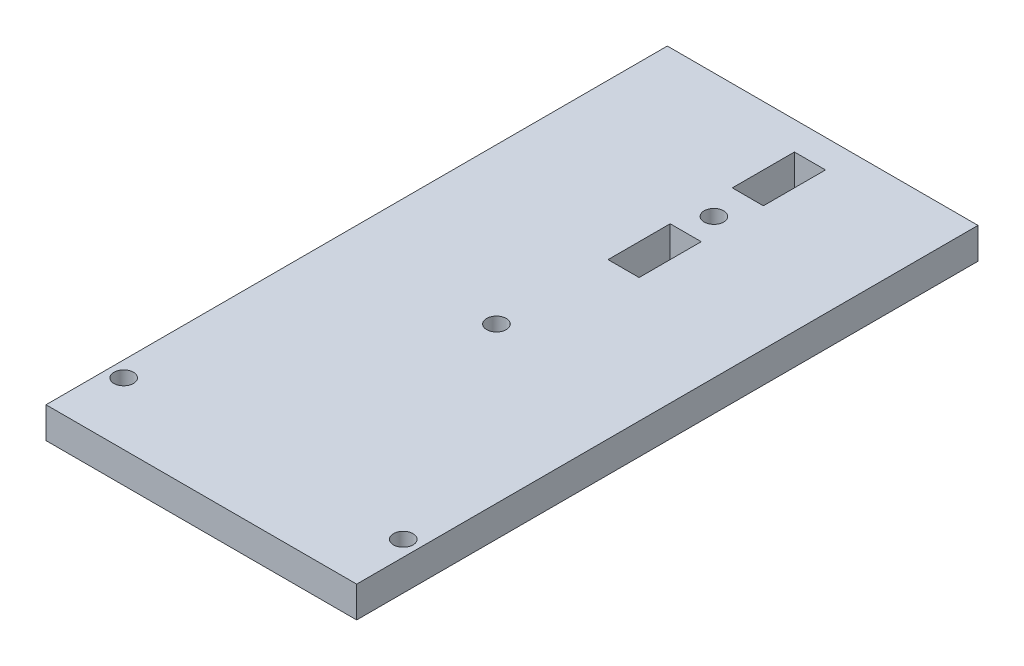
ISO-10303-21;
HEADER;
FILE_DESCRIPTION(('STEP AP214'),'2;1');
FILE_NAME('part.step','',(''),(''),'','','');
FILE_SCHEMA(('AUTOMOTIVE_DESIGN { 1 0 10303 214 1 1 1 1 }'));
ENDSEC;
DATA;
#1=APPLICATION_CONTEXT('core data for automotive mechanical design processes');
#2=APPLICATION_PROTOCOL_DEFINITION('international standard','automotive_design',2000,#1);
#3=PRODUCT_CONTEXT('',#1,'mechanical');
#4=PRODUCT('Part','Part','',(#3));
#5=PRODUCT_RELATED_PRODUCT_CATEGORY('part','',(#4));
#6=PRODUCT_DEFINITION_FORMATION('','',#4);
#7=PRODUCT_DEFINITION_CONTEXT('part definition',#1,'design');
#8=PRODUCT_DEFINITION('design','',#6,#7);
#9=PRODUCT_DEFINITION_SHAPE('','',#8);
#10=(LENGTH_UNIT() NAMED_UNIT(*) SI_UNIT(.MILLI.,.METRE.));
#11=(NAMED_UNIT(*) PLANE_ANGLE_UNIT() SI_UNIT($,.RADIAN.));
#12=(NAMED_UNIT(*) SI_UNIT($,.STERADIAN.) SOLID_ANGLE_UNIT());
#13=UNCERTAINTY_MEASURE_WITH_UNIT(LENGTH_MEASURE(1.E-05),#10,'distance_accuracy_value','');
#14=(GEOMETRIC_REPRESENTATION_CONTEXT(3) GLOBAL_UNCERTAINTY_ASSIGNED_CONTEXT((#13)) GLOBAL_UNIT_ASSIGNED_CONTEXT((#10,
#11,#12)) REPRESENTATION_CONTEXT('',''));
#15=CARTESIAN_POINT('',(0.,0.,0.));
#16=DIRECTION('',(0.,0.,1.));
#17=DIRECTION('',(1.,0.,0.));
#18=AXIS2_PLACEMENT_3D('',#15,#16,#17);
#19=CARTESIAN_POINT('',(0.,6.35,0.));
#20=DIRECTION('',(0.,-1.,0.));
#21=DIRECTION('',(0.,0.,-1.));
#22=AXIS2_PLACEMENT_3D('',#19,#20,#21);
#23=PLANE('',#22);
#24=DIRECTION('',(1.,0.,0.));
#25=VECTOR('',#24,1.);
#26=CARTESIAN_POINT('',(31.75,6.35,-108.530021549942));
#27=LINE('',#26,#25);
#28=CARTESIAN_POINT('',(31.75,6.35,-108.530021549942));
#29=VERTEX_POINT('',#28);
#30=CARTESIAN_POINT('',(38.1,6.35,-108.530021549942));
#31=VERTEX_POINT('',#30);
#32=EDGE_CURVE('E149',#29,#31,#27,.T.);
#33=ORIENTED_EDGE('',*,*,#32,.F.);
#34=DIRECTION('',(0.,0.,1.));
#35=VECTOR('',#34,1.);
#36=CARTESIAN_POINT('',(31.75,6.35,-108.530021549942));
#37=LINE('',#36,#35);
#38=CARTESIAN_POINT('',(31.75,6.35,-121.230021549942));
#39=VERTEX_POINT('',#38);
#40=EDGE_CURVE('E48',#39,#29,#37,.T.);
#41=ORIENTED_EDGE('',*,*,#40,.F.);
#42=DIRECTION('',(-1.,0.,0.));
#43=VECTOR('',#42,1.);
#44=CARTESIAN_POINT('',(31.75,6.35,-121.230021549942));
#45=LINE('',#44,#43);
#46=CARTESIAN_POINT('',(38.1,6.35,-121.230021549942));
#47=VERTEX_POINT('',#46);
#48=EDGE_CURVE('E140',#47,#39,#45,.T.);
#49=ORIENTED_EDGE('',*,*,#48,.F.);
#50=DIRECTION('',(0.,0.,-1.));
#51=VECTOR('',#50,1.);
#52=CARTESIAN_POINT('',(38.1,6.35,-108.530021549942));
#53=LINE('',#52,#51);
#54=EDGE_CURVE('E143',#31,#47,#53,.T.);
#55=ORIENTED_EDGE('',*,*,#54,.F.);
#56=EDGE_LOOP('',(#33,#41,#49,#55));
#57=FACE_BOUND('',#56,.T.);
#58=DIRECTION('',(1.,0.,0.));
#59=VECTOR('',#58,1.);
#60=CARTESIAN_POINT('',(31.75,6.35,-83.1300215499425));
#61=LINE('',#60,#59);
#62=CARTESIAN_POINT('',(31.75,6.35,-83.1300215499425));
#63=VERTEX_POINT('',#62);
#64=CARTESIAN_POINT('',(38.1,6.35,-83.1300215499425));
#65=VERTEX_POINT('',#64);
#66=EDGE_CURVE('E174',#63,#65,#61,.T.);
#67=ORIENTED_EDGE('',*,*,#66,.F.);
#68=DIRECTION('',(0.,0.,1.));
#69=VECTOR('',#68,1.);
#70=CARTESIAN_POINT('',(31.75,6.35,-95.8300215499425));
#71=LINE('',#70,#69);
#72=CARTESIAN_POINT('',(31.75,6.35,-95.8300215499425));
#73=VERTEX_POINT('',#72);
#74=EDGE_CURVE('E155',#73,#63,#71,.T.);
#75=ORIENTED_EDGE('',*,*,#74,.F.);
#76=DIRECTION('',(-1.,0.,0.));
#77=VECTOR('',#76,1.);
#78=CARTESIAN_POINT('',(31.75,6.35,-95.8300215499425));
#79=LINE('',#78,#77);
#80=CARTESIAN_POINT('',(38.1,6.35,-95.8300215499425));
#81=VERTEX_POINT('',#80);
#82=EDGE_CURVE('E163',#81,#73,#79,.T.);
#83=ORIENTED_EDGE('',*,*,#82,.F.);
#84=DIRECTION('',(0.,0.,-1.));
#85=VECTOR('',#84,1.);
#86=CARTESIAN_POINT('',(38.1,6.35,-95.8300215499425));
#87=LINE('',#86,#85);
#88=EDGE_CURVE('E177',#65,#81,#87,.T.);
#89=ORIENTED_EDGE('',*,*,#88,.F.);
#90=EDGE_LOOP('',(#67,#75,#83,#89));
#91=FACE_BOUND('',#90,.T.);
#92=CARTESIAN_POINT('',(34.925,6.35,-101.6));
#93=DIRECTION('',(0.,1.,0.));
#94=DIRECTION('',(0.,0.,1.));
#95=AXIS2_PLACEMENT_3D('',#92,#93,#94);
#96=CIRCLE('',#95,2.);
#97=CARTESIAN_POINT('',(34.925,6.35,-99.6));
#98=VERTEX_POINT('',#97);
#99=EDGE_CURVE('E184',#98,#98,#96,.T.);
#100=ORIENTED_EDGE('',*,*,#99,.F.);
#101=EDGE_LOOP('',(#100));
#102=FACE_BOUND('',#101,.T.);
#103=DIRECTION('',(0.,0.,1.));
#104=VECTOR('',#103,1.);
#105=CARTESIAN_POINT('',(0.,6.35,0.));
#106=LINE('',#105,#104);
#107=CARTESIAN_POINT('',(0.,6.35,-127.));
#108=VERTEX_POINT('',#107);
#109=CARTESIAN_POINT('',(0.,6.35,0.));
#110=VERTEX_POINT('',#109);
#111=EDGE_CURVE('E215',#108,#110,#106,.T.);
#112=ORIENTED_EDGE('',*,*,#111,.T.);
#113=DIRECTION('',(1.,0.,0.));
#114=VECTOR('',#113,1.);
#115=CARTESIAN_POINT('',(0.,6.35,0.));
#116=LINE('',#115,#114);
#117=CARTESIAN_POINT('',(63.5,6.35,0.));
#118=VERTEX_POINT('',#117);
#119=EDGE_CURVE('E218',#110,#118,#116,.T.);
#120=ORIENTED_EDGE('',*,*,#119,.T.);
#121=DIRECTION('',(0.,0.,-1.));
#122=VECTOR('',#121,1.);
#123=CARTESIAN_POINT('',(63.5,6.35,0.));
#124=LINE('',#123,#122);
#125=CARTESIAN_POINT('',(63.5,6.35,-127.));
#126=VERTEX_POINT('',#125);
#127=EDGE_CURVE('E221',#118,#126,#124,.T.);
#128=ORIENTED_EDGE('',*,*,#127,.T.);
#129=DIRECTION('',(-1.,0.,0.));
#130=VECTOR('',#129,1.);
#131=CARTESIAN_POINT('',(0.,6.35,-127.));
#132=LINE('',#131,#130);
#133=EDGE_CURVE('E223',#126,#108,#132,.T.);
#134=ORIENTED_EDGE('',*,*,#133,.T.);
#135=EDGE_LOOP('',(#112,#120,#128,#134));
#136=FACE_BOUND('',#135,.T.);
#137=CARTESIAN_POINT('',(3.175,6.35,-12.7));
#138=DIRECTION('',(0.,1.,0.));
#139=DIRECTION('',(0.,0.,1.));
#140=AXIS2_PLACEMENT_3D('',#137,#138,#139);
#141=CIRCLE('',#140,2.);
#142=CARTESIAN_POINT('',(3.175,6.35,-10.7));
#143=VERTEX_POINT('',#142);
#144=EDGE_CURVE('E209',#143,#143,#141,.T.);
#145=ORIENTED_EDGE('',*,*,#144,.F.);
#146=EDGE_LOOP('',(#145));
#147=FACE_BOUND('',#146,.T.);
#148=CARTESIAN_POINT('',(60.325,6.35,-12.7));
#149=DIRECTION('',(0.,1.,0.));
#150=DIRECTION('',(0.,0.,1.));
#151=AXIS2_PLACEMENT_3D('',#148,#149,#150);
#152=CIRCLE('',#151,2.);
#153=CARTESIAN_POINT('',(60.325,6.35,-10.7));
#154=VERTEX_POINT('',#153);
#155=EDGE_CURVE('E203',#154,#154,#152,.T.);
#156=ORIENTED_EDGE('',*,*,#155,.F.);
#157=EDGE_LOOP('',(#156));
#158=FACE_BOUND('',#157,.T.);
#159=CARTESIAN_POINT('',(31.75,6.35,-60.325));
#160=DIRECTION('',(0.,1.,0.));
#161=DIRECTION('',(0.,0.,1.));
#162=AXIS2_PLACEMENT_3D('',#159,#160,#161);
#163=CIRCLE('',#162,2.);
#164=CARTESIAN_POINT('',(31.75,6.35,-58.325));
#165=VERTEX_POINT('',#164);
#166=EDGE_CURVE('E197',#165,#165,#163,.T.);
#167=ORIENTED_EDGE('',*,*,#166,.F.);
#168=EDGE_LOOP('',(#167));
#169=FACE_BOUND('',#168,.T.);
#170=ADVANCED_FACE('F33',(#57,#91,#102,#136,#147,#158,#169),#23,.F.);
#171=CARTESIAN_POINT('',(0.,0.,0.));
#172=DIRECTION('',(0.,-1.,0.));
#173=DIRECTION('',(0.,0.,-1.));
#174=AXIS2_PLACEMENT_3D('',#171,#172,#173);
#175=PLANE('',#174);
#176=DIRECTION('',(0.,0.,1.));
#177=VECTOR('',#176,1.);
#178=CARTESIAN_POINT('',(31.75,0.,-108.530021549942));
#179=LINE('',#178,#177);
#180=CARTESIAN_POINT('',(31.75,0.,-121.230021549942));
#181=VERTEX_POINT('',#180);
#182=CARTESIAN_POINT('',(31.75,0.,-108.530021549942));
#183=VERTEX_POINT('',#182);
#184=EDGE_CURVE('E124',#181,#183,#179,.T.);
#185=ORIENTED_EDGE('',*,*,#184,.T.);
#186=DIRECTION('',(1.,0.,0.));
#187=VECTOR('',#186,1.);
#188=CARTESIAN_POINT('',(31.75,0.,-108.530021549942));
#189=LINE('',#188,#187);
#190=CARTESIAN_POINT('',(38.1,0.,-108.530021549942));
#191=VERTEX_POINT('',#190);
#192=EDGE_CURVE('E133',#183,#191,#189,.T.);
#193=ORIENTED_EDGE('',*,*,#192,.T.);
#194=DIRECTION('',(0.,0.,-1.));
#195=VECTOR('',#194,1.);
#196=CARTESIAN_POINT('',(38.1,0.,-108.530021549942));
#197=LINE('',#196,#195);
#198=CARTESIAN_POINT('',(38.1,0.,-121.230021549942));
#199=VERTEX_POINT('',#198);
#200=EDGE_CURVE('E56',#191,#199,#197,.T.);
#201=ORIENTED_EDGE('',*,*,#200,.T.);
#202=DIRECTION('',(-1.,0.,0.));
#203=VECTOR('',#202,1.);
#204=CARTESIAN_POINT('',(31.75,0.,-121.230021549942));
#205=LINE('',#204,#203);
#206=EDGE_CURVE('E130',#199,#181,#205,.T.);
#207=ORIENTED_EDGE('',*,*,#206,.T.);
#208=EDGE_LOOP('',(#185,#193,#201,#207));
#209=FACE_BOUND('',#208,.T.);
#210=DIRECTION('',(0.,0.,1.));
#211=VECTOR('',#210,1.);
#212=CARTESIAN_POINT('',(31.75,0.,-95.8300215499425));
#213=LINE('',#212,#211);
#214=CARTESIAN_POINT('',(31.75,0.,-95.8300215499425));
#215=VERTEX_POINT('',#214);
#216=CARTESIAN_POINT('',(31.75,0.,-83.1300215499425));
#217=VERTEX_POINT('',#216);
#218=EDGE_CURVE('E159',#215,#217,#213,.T.);
#219=ORIENTED_EDGE('',*,*,#218,.T.);
#220=DIRECTION('',(1.,0.,0.));
#221=VECTOR('',#220,1.);
#222=CARTESIAN_POINT('',(31.75,0.,-83.1300215499425));
#223=LINE('',#222,#221);
#224=CARTESIAN_POINT('',(38.1,0.,-83.1300215499425));
#225=VERTEX_POINT('',#224);
#226=EDGE_CURVE('E162',#217,#225,#223,.T.);
#227=ORIENTED_EDGE('',*,*,#226,.T.);
#228=DIRECTION('',(0.,0.,-1.));
#229=VECTOR('',#228,1.);
#230=CARTESIAN_POINT('',(38.1,0.,-95.8300215499425));
#231=LINE('',#230,#229);
#232=CARTESIAN_POINT('',(38.1,0.,-95.8300215499425));
#233=VERTEX_POINT('',#232);
#234=EDGE_CURVE('E166',#225,#233,#231,.T.);
#235=ORIENTED_EDGE('',*,*,#234,.T.);
#236=DIRECTION('',(-1.,0.,0.));
#237=VECTOR('',#236,1.);
#238=CARTESIAN_POINT('',(31.75,0.,-95.8300215499425));
#239=LINE('',#238,#237);
#240=EDGE_CURVE('E169',#233,#215,#239,.T.);
#241=ORIENTED_EDGE('',*,*,#240,.T.);
#242=EDGE_LOOP('',(#219,#227,#235,#241));
#243=FACE_BOUND('',#242,.T.);
#244=CARTESIAN_POINT('',(34.925,0.,-101.6));
#245=DIRECTION('',(0.,1.,0.));
#246=DIRECTION('',(0.,0.,1.));
#247=AXIS2_PLACEMENT_3D('',#244,#245,#246);
#248=CIRCLE('',#247,2.);
#249=CARTESIAN_POINT('',(34.925,0.,-99.6));
#250=VERTEX_POINT('',#249);
#251=EDGE_CURVE('E191',#250,#250,#248,.T.);
#252=ORIENTED_EDGE('',*,*,#251,.T.);
#253=EDGE_LOOP('',(#252));
#254=FACE_BOUND('',#253,.T.);
#255=CARTESIAN_POINT('',(60.325,0.,-12.7));
#256=DIRECTION('',(0.,1.,0.));
#257=DIRECTION('',(0.,0.,1.));
#258=AXIS2_PLACEMENT_3D('',#255,#256,#257);
#259=CIRCLE('',#258,2.);
#260=CARTESIAN_POINT('',(60.325,0.,-10.7));
#261=VERTEX_POINT('',#260);
#262=EDGE_CURVE('E200',#261,#261,#259,.T.);
#263=ORIENTED_EDGE('',*,*,#262,.T.);
#264=EDGE_LOOP('',(#263));
#265=FACE_BOUND('',#264,.T.);
#266=DIRECTION('',(0.,0.,1.));
#267=VECTOR('',#266,1.);
#268=CARTESIAN_POINT('',(0.,0.,0.));
#269=LINE('',#268,#267);
#270=CARTESIAN_POINT('',(0.,0.,-127.));
#271=VERTEX_POINT('',#270);
#272=CARTESIAN_POINT('',(0.,0.,0.));
#273=VERTEX_POINT('',#272);
#274=EDGE_CURVE('E212',#271,#273,#269,.T.);
#275=ORIENTED_EDGE('',*,*,#274,.F.);
#276=DIRECTION('',(-1.,0.,0.));
#277=VECTOR('',#276,1.);
#278=CARTESIAN_POINT('',(0.,0.,-127.));
#279=LINE('',#278,#277);
#280=CARTESIAN_POINT('',(63.5,0.,-127.));
#281=VERTEX_POINT('',#280);
#282=EDGE_CURVE('E219',#281,#271,#279,.T.);
#283=ORIENTED_EDGE('',*,*,#282,.F.);
#284=DIRECTION('',(0.,0.,-1.));
#285=VECTOR('',#284,1.);
#286=CARTESIAN_POINT('',(63.5,0.,0.));
#287=LINE('',#286,#285);
#288=CARTESIAN_POINT('',(63.5,0.,0.));
#289=VERTEX_POINT('',#288);
#290=EDGE_CURVE('E230',#289,#281,#287,.T.);
#291=ORIENTED_EDGE('',*,*,#290,.F.);
#292=DIRECTION('',(1.,0.,0.));
#293=VECTOR('',#292,1.);
#294=CARTESIAN_POINT('',(0.,0.,0.));
#295=LINE('',#294,#293);
#296=EDGE_CURVE('E228',#273,#289,#295,.T.);
#297=ORIENTED_EDGE('',*,*,#296,.F.);
#298=EDGE_LOOP('',(#275,#283,#291,#297));
#299=FACE_BOUND('',#298,.T.);
#300=CARTESIAN_POINT('',(3.175,0.,-12.7));
#301=DIRECTION('',(0.,1.,0.));
#302=DIRECTION('',(0.,0.,1.));
#303=AXIS2_PLACEMENT_3D('',#300,#301,#302);
#304=CIRCLE('',#303,2.);
#305=CARTESIAN_POINT('',(3.175,0.,-10.7));
#306=VERTEX_POINT('',#305);
#307=EDGE_CURVE('E206',#306,#306,#304,.T.);
#308=ORIENTED_EDGE('',*,*,#307,.T.);
#309=EDGE_LOOP('',(#308));
#310=FACE_BOUND('',#309,.T.);
#311=CARTESIAN_POINT('',(31.75,0.,-60.325));
#312=DIRECTION('',(0.,1.,0.));
#313=DIRECTION('',(0.,0.,1.));
#314=AXIS2_PLACEMENT_3D('',#311,#312,#313);
#315=CIRCLE('',#314,2.);
#316=CARTESIAN_POINT('',(31.75,0.,-58.325));
#317=VERTEX_POINT('',#316);
#318=EDGE_CURVE('E194',#317,#317,#315,.T.);
#319=ORIENTED_EDGE('',*,*,#318,.T.);
#320=EDGE_LOOP('',(#319));
#321=FACE_BOUND('',#320,.T.);
#322=ADVANCED_FACE('F137',(#209,#243,#254,#265,#299,#310,#321),#175,.T.);
#323=CARTESIAN_POINT('',(0.,6.35,0.));
#324=DIRECTION('',(1.,0.,0.));
#325=DIRECTION('',(0.,0.,-1.));
#326=AXIS2_PLACEMENT_3D('',#323,#324,#325);
#327=PLANE('',#326);
#328=ORIENTED_EDGE('',*,*,#274,.T.);
#329=DIRECTION('',(0.,-1.,0.));
#330=VECTOR('',#329,1.);
#331=CARTESIAN_POINT('',(0.,6.35,0.));
#332=LINE('',#331,#330);
#333=EDGE_CURVE('E11',#110,#273,#332,.T.);
#334=ORIENTED_EDGE('',*,*,#333,.F.);
#335=ORIENTED_EDGE('',*,*,#111,.F.);
#336=DIRECTION('',(0.,-1.,0.));
#337=VECTOR('',#336,1.);
#338=CARTESIAN_POINT('',(0.,6.35,-127.));
#339=LINE('',#338,#337);
#340=EDGE_CURVE('E225',#108,#271,#339,.T.);
#341=ORIENTED_EDGE('',*,*,#340,.T.);
#342=EDGE_LOOP('',(#328,#334,#335,#341));
#343=FACE_BOUND('',#342,.T.);
#344=ADVANCED_FACE('F35',(#343),#327,.F.);
#345=CARTESIAN_POINT('',(0.,6.35,0.));
#346=DIRECTION('',(0.,0.,-1.));
#347=DIRECTION('',(-1.,0.,0.));
#348=AXIS2_PLACEMENT_3D('',#345,#346,#347);
#349=PLANE('',#348);
#350=ORIENTED_EDGE('',*,*,#296,.T.);
#351=DIRECTION('',(0.,-1.,0.));
#352=VECTOR('',#351,1.);
#353=CARTESIAN_POINT('',(63.5,6.35,0.));
#354=LINE('',#353,#352);
#355=EDGE_CURVE('E41',#118,#289,#354,.T.);
#356=ORIENTED_EDGE('',*,*,#355,.F.);
#357=ORIENTED_EDGE('',*,*,#119,.F.);
#358=ORIENTED_EDGE('',*,*,#333,.T.);
#359=EDGE_LOOP('',(#350,#356,#357,#358));
#360=FACE_BOUND('',#359,.T.);
#361=ADVANCED_FACE('F258',(#360),#349,.F.);
#362=CARTESIAN_POINT('',(63.5,6.35,0.));
#363=DIRECTION('',(-1.,0.,0.));
#364=DIRECTION('',(0.,0.,1.));
#365=AXIS2_PLACEMENT_3D('',#362,#363,#364);
#366=PLANE('',#365);
#367=ORIENTED_EDGE('',*,*,#290,.T.);
#368=DIRECTION('',(0.,-1.,0.));
#369=VECTOR('',#368,1.);
#370=CARTESIAN_POINT('',(63.5,6.35,-127.));
#371=LINE('',#370,#369);
#372=EDGE_CURVE('E235',#126,#281,#371,.T.);
#373=ORIENTED_EDGE('',*,*,#372,.F.);
#374=ORIENTED_EDGE('',*,*,#127,.F.);
#375=ORIENTED_EDGE('',*,*,#355,.T.);
#376=EDGE_LOOP('',(#367,#373,#374,#375));
#377=FACE_BOUND('',#376,.T.);
#378=ADVANCED_FACE('F242',(#377),#366,.F.);
#379=CARTESIAN_POINT('',(0.,6.35,-127.));
#380=DIRECTION('',(0.,0.,1.));
#381=DIRECTION('',(1.,0.,0.));
#382=AXIS2_PLACEMENT_3D('',#379,#380,#381);
#383=PLANE('',#382);
#384=ORIENTED_EDGE('',*,*,#282,.T.);
#385=ORIENTED_EDGE('',*,*,#340,.F.);
#386=ORIENTED_EDGE('',*,*,#133,.F.);
#387=ORIENTED_EDGE('',*,*,#372,.T.);
#388=EDGE_LOOP('',(#384,#385,#386,#387));
#389=FACE_BOUND('',#388,.T.);
#390=ADVANCED_FACE('F251',(#389),#383,.F.);
#391=CARTESIAN_POINT('',(3.175,6.35,-12.7));
#392=DIRECTION('',(0.,-1.,0.));
#393=DIRECTION('',(0.,0.,-1.));
#394=AXIS2_PLACEMENT_3D('',#391,#392,#393);
#395=CYLINDRICAL_SURFACE('',#394,2.);
#396=ORIENTED_EDGE('',*,*,#144,.T.);
#397=EDGE_LOOP('',(#396));
#398=FACE_BOUND('',#397,.T.);
#399=ORIENTED_EDGE('',*,*,#307,.F.);
#400=EDGE_LOOP('',(#399));
#401=FACE_BOUND('',#400,.T.);
#402=ADVANCED_FACE('F274',(#398,#401),#395,.F.);
#403=CARTESIAN_POINT('',(60.325,6.35,-12.7));
#404=DIRECTION('',(0.,-1.,0.));
#405=DIRECTION('',(0.,0.,-1.));
#406=AXIS2_PLACEMENT_3D('',#403,#404,#405);
#407=CYLINDRICAL_SURFACE('',#406,2.);
#408=ORIENTED_EDGE('',*,*,#155,.T.);
#409=EDGE_LOOP('',(#408));
#410=FACE_BOUND('',#409,.T.);
#411=ORIENTED_EDGE('',*,*,#262,.F.);
#412=EDGE_LOOP('',(#411));
#413=FACE_BOUND('',#412,.T.);
#414=ADVANCED_FACE('F281',(#410,#413),#407,.F.);
#415=CARTESIAN_POINT('',(31.75,6.35,-60.325));
#416=DIRECTION('',(0.,-1.,0.));
#417=DIRECTION('',(0.,0.,-1.));
#418=AXIS2_PLACEMENT_3D('',#415,#416,#417);
#419=CYLINDRICAL_SURFACE('',#418,2.);
#420=ORIENTED_EDGE('',*,*,#166,.T.);
#421=EDGE_LOOP('',(#420));
#422=FACE_BOUND('',#421,.T.);
#423=ORIENTED_EDGE('',*,*,#318,.F.);
#424=EDGE_LOOP('',(#423));
#425=FACE_BOUND('',#424,.T.);
#426=ADVANCED_FACE('F286',(#422,#425),#419,.F.);
#427=CARTESIAN_POINT('',(34.925,0.,-101.6));
#428=DIRECTION('',(0.,1.,0.));
#429=DIRECTION('',(0.,0.,1.));
#430=AXIS2_PLACEMENT_3D('',#427,#428,#429);
#431=CYLINDRICAL_SURFACE('',#430,2.);
#432=ORIENTED_EDGE('',*,*,#251,.F.);
#433=EDGE_LOOP('',(#432));
#434=FACE_BOUND('',#433,.T.);
#435=ORIENTED_EDGE('',*,*,#99,.T.);
#436=EDGE_LOOP('',(#435));
#437=FACE_BOUND('',#436,.T.);
#438=ADVANCED_FACE('F295',(#434,#437),#431,.F.);
#439=CARTESIAN_POINT('',(31.75,0.,-95.8300215499425));
#440=DIRECTION('',(-1.,0.,0.));
#441=DIRECTION('',(0.,0.,1.));
#442=AXIS2_PLACEMENT_3D('',#439,#440,#441);
#443=PLANE('',#442);
#444=ORIENTED_EDGE('',*,*,#74,.T.);
#445=DIRECTION('',(0.,1.,0.));
#446=VECTOR('',#445,1.);
#447=CARTESIAN_POINT('',(31.75,0.,-83.1300215499425));
#448=LINE('',#447,#446);
#449=EDGE_CURVE('E172',#217,#63,#448,.T.);
#450=ORIENTED_EDGE('',*,*,#449,.F.);
#451=ORIENTED_EDGE('',*,*,#218,.F.);
#452=DIRECTION('',(0.,1.,0.));
#453=VECTOR('',#452,1.);
#454=CARTESIAN_POINT('',(31.75,0.,-95.8300215499425));
#455=LINE('',#454,#453);
#456=EDGE_CURVE('E182',#215,#73,#455,.T.);
#457=ORIENTED_EDGE('',*,*,#456,.T.);
#458=EDGE_LOOP('',(#444,#450,#451,#457));
#459=FACE_BOUND('',#458,.T.);
#460=ADVANCED_FACE('F301',(#459),#443,.F.);
#461=CARTESIAN_POINT('',(31.75,0.,-95.8300215499425));
#462=DIRECTION('',(0.,0.,-1.));
#463=DIRECTION('',(-1.,0.,0.));
#464=AXIS2_PLACEMENT_3D('',#461,#462,#463);
#465=PLANE('',#464);
#466=ORIENTED_EDGE('',*,*,#82,.T.);
#467=ORIENTED_EDGE('',*,*,#456,.F.);
#468=ORIENTED_EDGE('',*,*,#240,.F.);
#469=DIRECTION('',(0.,1.,0.));
#470=VECTOR('',#469,1.);
#471=CARTESIAN_POINT('',(38.1,0.,-95.8300215499425));
#472=LINE('',#471,#470);
#473=EDGE_CURVE('E185',#233,#81,#472,.T.);
#474=ORIENTED_EDGE('',*,*,#473,.T.);
#475=EDGE_LOOP('',(#466,#467,#468,#474));
#476=FACE_BOUND('',#475,.T.);
#477=ADVANCED_FACE('F307',(#476),#465,.F.);
#478=CARTESIAN_POINT('',(38.1,0.,-95.8300215499425));
#479=DIRECTION('',(1.,0.,0.));
#480=DIRECTION('',(0.,0.,-1.));
#481=AXIS2_PLACEMENT_3D('',#478,#479,#480);
#482=PLANE('',#481);
#483=ORIENTED_EDGE('',*,*,#88,.T.);
#484=ORIENTED_EDGE('',*,*,#473,.F.);
#485=ORIENTED_EDGE('',*,*,#234,.F.);
#486=DIRECTION('',(0.,1.,0.));
#487=VECTOR('',#486,1.);
#488=CARTESIAN_POINT('',(38.1,0.,-83.1300215499425));
#489=LINE('',#488,#487);
#490=EDGE_CURVE('E187',#225,#65,#489,.T.);
#491=ORIENTED_EDGE('',*,*,#490,.T.);
#492=EDGE_LOOP('',(#483,#484,#485,#491));
#493=FACE_BOUND('',#492,.T.);
#494=ADVANCED_FACE('F312',(#493),#482,.F.);
#495=CARTESIAN_POINT('',(31.75,0.,-83.1300215499425));
#496=DIRECTION('',(0.,0.,1.));
#497=DIRECTION('',(1.,0.,0.));
#498=AXIS2_PLACEMENT_3D('',#495,#496,#497);
#499=PLANE('',#498);
#500=ORIENTED_EDGE('',*,*,#66,.T.);
#501=ORIENTED_EDGE('',*,*,#490,.F.);
#502=ORIENTED_EDGE('',*,*,#226,.F.);
#503=ORIENTED_EDGE('',*,*,#449,.T.);
#504=EDGE_LOOP('',(#500,#501,#502,#503));
#505=FACE_BOUND('',#504,.T.);
#506=ADVANCED_FACE('F309',(#505),#499,.F.);
#507=CARTESIAN_POINT('',(31.75,0.,-108.530021549942));
#508=DIRECTION('',(-1.,0.,0.));
#509=DIRECTION('',(0.,0.,1.));
#510=AXIS2_PLACEMENT_3D('',#507,#508,#509);
#511=PLANE('',#510);
#512=ORIENTED_EDGE('',*,*,#40,.T.);
#513=DIRECTION('',(0.,1.,0.));
#514=VECTOR('',#513,1.);
#515=CARTESIAN_POINT('',(31.75,0.,-108.530021549942));
#516=LINE('',#515,#514);
#517=EDGE_CURVE('E120',#183,#29,#516,.T.);
#518=ORIENTED_EDGE('',*,*,#517,.F.);
#519=ORIENTED_EDGE('',*,*,#184,.F.);
#520=DIRECTION('',(0.,1.,0.));
#521=VECTOR('',#520,1.);
#522=CARTESIAN_POINT('',(31.75,0.,-121.230021549942));
#523=LINE('',#522,#521);
#524=EDGE_CURVE('E153',#181,#39,#523,.T.);
#525=ORIENTED_EDGE('',*,*,#524,.T.);
#526=EDGE_LOOP('',(#512,#518,#519,#525));
#527=FACE_BOUND('',#526,.T.);
#528=ADVANCED_FACE('F122',(#527),#511,.F.);
#529=CARTESIAN_POINT('',(31.75,0.,-121.230021549942));
#530=DIRECTION('',(0.,0.,-1.));
#531=DIRECTION('',(-1.,0.,0.));
#532=AXIS2_PLACEMENT_3D('',#529,#530,#531);
#533=PLANE('',#532);
#534=ORIENTED_EDGE('',*,*,#48,.T.);
#535=ORIENTED_EDGE('',*,*,#524,.F.);
#536=ORIENTED_EDGE('',*,*,#206,.F.);
#537=DIRECTION('',(0.,1.,0.));
#538=VECTOR('',#537,1.);
#539=CARTESIAN_POINT('',(38.1,0.,-121.230021549942));
#540=LINE('',#539,#538);
#541=EDGE_CURVE('E156',#199,#47,#540,.T.);
#542=ORIENTED_EDGE('',*,*,#541,.T.);
#543=EDGE_LOOP('',(#534,#535,#536,#542));
#544=FACE_BOUND('',#543,.T.);
#545=ADVANCED_FACE('F322',(#544),#533,.F.);
#546=CARTESIAN_POINT('',(38.1,0.,-108.530021549942));
#547=DIRECTION('',(1.,0.,0.));
#548=DIRECTION('',(0.,0.,-1.));
#549=AXIS2_PLACEMENT_3D('',#546,#547,#548);
#550=PLANE('',#549);
#551=ORIENTED_EDGE('',*,*,#54,.T.);
#552=ORIENTED_EDGE('',*,*,#541,.F.);
#553=ORIENTED_EDGE('',*,*,#200,.F.);
#554=DIRECTION('',(0.,1.,0.));
#555=VECTOR('',#554,1.);
#556=CARTESIAN_POINT('',(38.1,0.,-108.530021549942));
#557=LINE('',#556,#555);
#558=EDGE_CURVE('E129',#191,#31,#557,.T.);
#559=ORIENTED_EDGE('',*,*,#558,.T.);
#560=EDGE_LOOP('',(#551,#552,#553,#559));
#561=FACE_BOUND('',#560,.T.);
#562=ADVANCED_FACE('F325',(#561),#550,.F.);
#563=CARTESIAN_POINT('',(31.75,0.,-108.530021549942));
#564=DIRECTION('',(0.,0.,1.));
#565=DIRECTION('',(1.,0.,0.));
#566=AXIS2_PLACEMENT_3D('',#563,#564,#565);
#567=PLANE('',#566);
#568=ORIENTED_EDGE('',*,*,#32,.T.);
#569=ORIENTED_EDGE('',*,*,#558,.F.);
#570=ORIENTED_EDGE('',*,*,#192,.F.);
#571=ORIENTED_EDGE('',*,*,#517,.T.);
#572=EDGE_LOOP('',(#568,#569,#570,#571));
#573=FACE_BOUND('',#572,.T.);
#574=ADVANCED_FACE('F134',(#573),#567,.F.);
#575=CLOSED_SHELL('',(#170,#322,#344,#361,#378,#390,#402,#414,#426,#438,#460,#477,#494,#506,
#528,#545,#562,#574));
#576=MANIFOLD_SOLID_BREP('B2',#575);
#577=ADVANCED_BREP_SHAPE_REPRESENTATION('',(#18,#576),#14);
#578=SHAPE_DEFINITION_REPRESENTATION(#9,#577);
ENDSEC;
END-ISO-10303-21;
